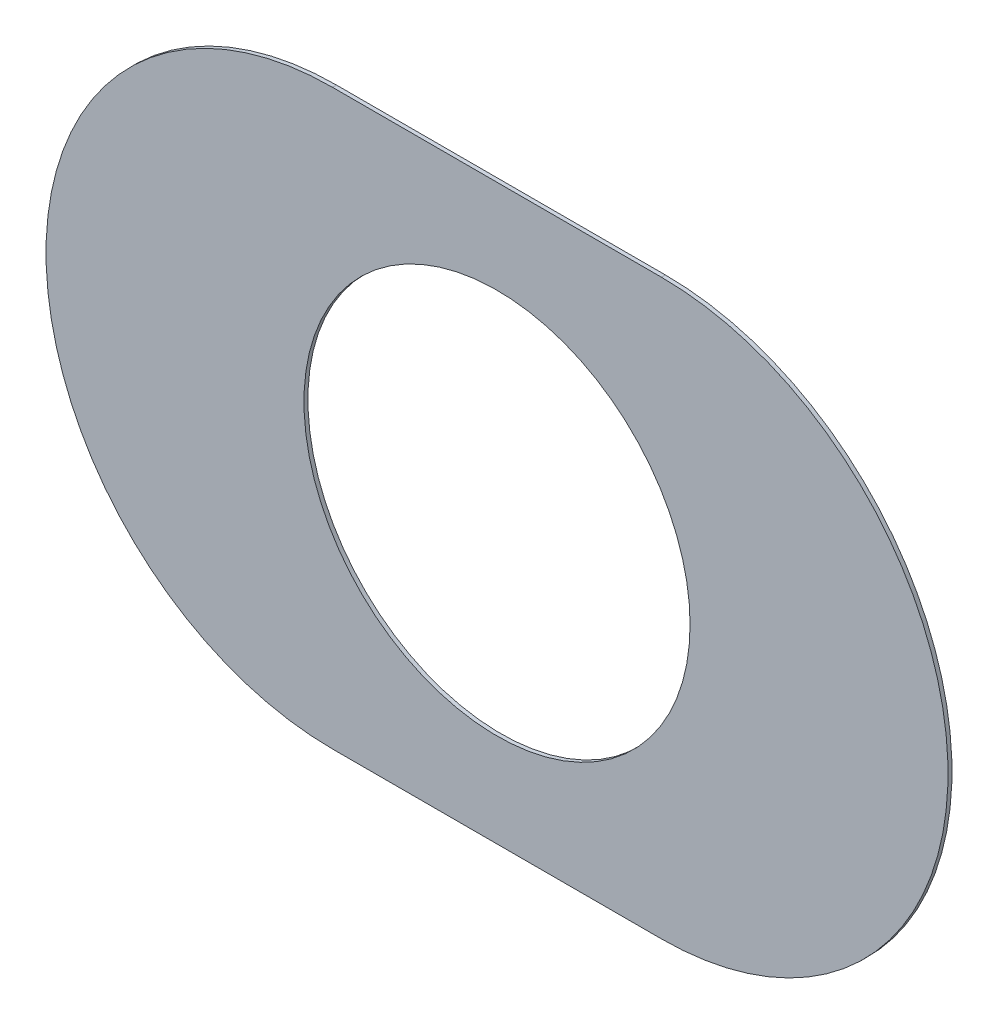
ISO-10303-21;
HEADER;
FILE_DESCRIPTION(('STEP AP214'),'2;1');
FILE_NAME('part.step','',(''),(''),'','','');
FILE_SCHEMA(('AUTOMOTIVE_DESIGN { 1 0 10303 214 1 1 1 1 }'));
ENDSEC;
DATA;
#1=APPLICATION_CONTEXT('core data for automotive mechanical design processes');
#2=APPLICATION_PROTOCOL_DEFINITION('international standard','automotive_design',2000,#1);
#3=PRODUCT_CONTEXT('',#1,'mechanical');
#4=PRODUCT('Part','Part','',(#3));
#5=PRODUCT_RELATED_PRODUCT_CATEGORY('part','',(#4));
#6=PRODUCT_DEFINITION_FORMATION('','',#4);
#7=PRODUCT_DEFINITION_CONTEXT('part definition',#1,'design');
#8=PRODUCT_DEFINITION('design','',#6,#7);
#9=PRODUCT_DEFINITION_SHAPE('','',#8);
#10=(LENGTH_UNIT() NAMED_UNIT(*) SI_UNIT(.MILLI.,.METRE.));
#11=(NAMED_UNIT(*) PLANE_ANGLE_UNIT() SI_UNIT($,.RADIAN.));
#12=(NAMED_UNIT(*) SI_UNIT($,.STERADIAN.) SOLID_ANGLE_UNIT());
#13=UNCERTAINTY_MEASURE_WITH_UNIT(LENGTH_MEASURE(1.E-05),#10,'distance_accuracy_value','');
#14=(GEOMETRIC_REPRESENTATION_CONTEXT(3) GLOBAL_UNCERTAINTY_ASSIGNED_CONTEXT((#13)) GLOBAL_UNIT_ASSIGNED_CONTEXT((#10,
#11,#12)) REPRESENTATION_CONTEXT('',''));
#15=CARTESIAN_POINT('',(0.,0.,0.));
#16=DIRECTION('',(0.,0.,1.));
#17=DIRECTION('',(1.,0.,0.));
#18=AXIS2_PLACEMENT_3D('',#15,#16,#17);
#19=CARTESIAN_POINT('',(24.3000003427268,42.4800006854535,0.));
#20=DIRECTION('',(0.,0.,1.));
#21=DIRECTION('',(1.,0.,0.));
#22=AXIS2_PLACEMENT_3D('',#19,#20,#21);
#23=PLANE('',#22);
#24=CARTESIAN_POINT('',(24.3000003427268,42.4800006854535,0.));
#25=DIRECTION('',(0.,0.,-1.));
#26=DIRECTION('',(-1.,0.,0.));
#27=AXIS2_PLACEMENT_3D('',#24,#25,#26);
#28=CIRCLE('',#27,0.49);
#29=CARTESIAN_POINT('',(24.7900003427268,42.4800006854535,0.));
#30=VERTEX_POINT('',#29);
#31=EDGE_CURVE('E21',#30,#30,#28,.T.);
#32=ORIENTED_EDGE('',*,*,#31,.T.);
#33=EDGE_LOOP('',(#32));
#34=FACE_BOUND('',#33,.T.);
#35=CARTESIAN_POINT('',(23.8825938881802,42.4800006854535,0.));
#36=DIRECTION('',(0.,0.,1.));
#37=DIRECTION('',(0.,1.,0.));
#38=AXIS2_PLACEMENT_3D('',#35,#36,#37);
#39=CIRCLE('',#38,0.727257121659981);
#40=CARTESIAN_POINT('',(23.8825938881802,43.2072578071135,0.));
#41=VERTEX_POINT('',#40);
#42=CARTESIAN_POINT('',(23.8825938881802,41.7527435637935,0.));
#43=VERTEX_POINT('',#42);
#44=EDGE_CURVE('E28',#41,#43,#39,.T.);
#45=ORIENTED_EDGE('',*,*,#44,.T.);
#46=DIRECTION('',(1.,0.,0.));
#47=VECTOR('',#46,1.);
#48=CARTESIAN_POINT('',(23.8825938881802,41.7527435637935,0.));
#49=LINE('',#48,#47);
#50=CARTESIAN_POINT('',(24.7174067972734,41.7527435637935,0.));
#51=VERTEX_POINT('',#50);
#52=EDGE_CURVE('E93',#43,#51,#49,.T.);
#53=ORIENTED_EDGE('',*,*,#52,.T.);
#54=CARTESIAN_POINT('',(24.7174067972734,42.4800006854535,0.));
#55=DIRECTION('',(0.,0.,1.));
#56=DIRECTION('',(0.,-1.,0.));
#57=AXIS2_PLACEMENT_3D('',#54,#55,#56);
#58=CIRCLE('',#57,0.727257121659981);
#59=CARTESIAN_POINT('',(24.7174067972734,43.2072578071135,0.));
#60=VERTEX_POINT('',#59);
#61=EDGE_CURVE('E114',#51,#60,#58,.T.);
#62=ORIENTED_EDGE('',*,*,#61,.T.);
#63=DIRECTION('',(-1.,0.,0.));
#64=VECTOR('',#63,1.);
#65=CARTESIAN_POINT('',(24.7174067972734,43.2072578071135,0.));
#66=LINE('',#65,#64);
#67=EDGE_CURVE('E105',#60,#41,#66,.T.);
#68=ORIENTED_EDGE('',*,*,#67,.T.);
#69=EDGE_LOOP('',(#45,#53,#62,#68));
#70=FACE_BOUND('',#69,.T.);
#71=ADVANCED_FACE('F17',(#34,#70),#23,.T.);
#72=CARTESIAN_POINT('',(24.3000003427268,42.4800006854535,-0.01));
#73=DIRECTION('',(0.,0.,1.));
#74=DIRECTION('',(1.,0.,0.));
#75=AXIS2_PLACEMENT_3D('',#72,#73,#74);
#76=PLANE('',#75);
#77=CARTESIAN_POINT('',(24.3000003427268,42.4800006854535,-0.01));
#78=DIRECTION('',(0.,0.,-1.));
#79=DIRECTION('',(-1.,0.,0.));
#80=AXIS2_PLACEMENT_3D('',#77,#78,#79);
#81=CIRCLE('',#80,0.49);
#82=CARTESIAN_POINT('',(24.7900003427268,42.4800006854535,-0.01));
#83=VERTEX_POINT('',#82);
#84=EDGE_CURVE('E140',#83,#83,#81,.T.);
#85=ORIENTED_EDGE('',*,*,#84,.F.);
#86=EDGE_LOOP('',(#85));
#87=FACE_BOUND('',#86,.T.);
#88=CARTESIAN_POINT('',(23.8825938881802,42.4800006854535,-0.01));
#89=DIRECTION('',(0.,0.,1.));
#90=DIRECTION('',(0.,1.,0.));
#91=AXIS2_PLACEMENT_3D('',#88,#89,#90);
#92=CIRCLE('',#91,0.727257121659981);
#93=CARTESIAN_POINT('',(23.8825938881802,43.2072578071135,-0.01));
#94=VERTEX_POINT('',#93);
#95=CARTESIAN_POINT('',(23.8825938881802,41.7527435637935,-0.01));
#96=VERTEX_POINT('',#95);
#97=EDGE_CURVE('E11',#94,#96,#92,.T.);
#98=ORIENTED_EDGE('',*,*,#97,.F.);
#99=DIRECTION('',(-1.,0.,0.));
#100=VECTOR('',#99,1.);
#101=CARTESIAN_POINT('',(24.7174067972734,43.2072578071135,-0.01));
#102=LINE('',#101,#100);
#103=CARTESIAN_POINT('',(24.7174067972734,43.2072578071135,-0.01));
#104=VERTEX_POINT('',#103);
#105=EDGE_CURVE('E96',#104,#94,#102,.T.);
#106=ORIENTED_EDGE('',*,*,#105,.F.);
#107=CARTESIAN_POINT('',(24.7174067972734,42.4800006854535,-0.01));
#108=DIRECTION('',(0.,0.,1.));
#109=DIRECTION('',(0.,-1.,0.));
#110=AXIS2_PLACEMENT_3D('',#107,#108,#109);
#111=CIRCLE('',#110,0.727257121659981);
#112=CARTESIAN_POINT('',(24.7174067972734,41.7527435637935,-0.01));
#113=VERTEX_POINT('',#112);
#114=EDGE_CURVE('E83',#113,#104,#111,.T.);
#115=ORIENTED_EDGE('',*,*,#114,.F.);
#116=DIRECTION('',(1.,0.,0.));
#117=VECTOR('',#116,1.);
#118=CARTESIAN_POINT('',(23.8825938881802,41.7527435637935,-0.01));
#119=LINE('',#118,#117);
#120=EDGE_CURVE('E123',#96,#113,#119,.T.);
#121=ORIENTED_EDGE('',*,*,#120,.F.);
#122=EDGE_LOOP('',(#98,#106,#115,#121));
#123=FACE_BOUND('',#122,.T.);
#124=ADVANCED_FACE('F97',(#87,#123),#76,.F.);
#125=CARTESIAN_POINT('',(23.8825938881802,42.4800006854535,0.));
#126=DIRECTION('',(0.,0.,1.));
#127=DIRECTION('',(0.,1.,0.));
#128=AXIS2_PLACEMENT_3D('',#125,#126,#127);
#129=CYLINDRICAL_SURFACE('',#128,0.727257121659981);
#130=ORIENTED_EDGE('',*,*,#44,.F.);
#131=DIRECTION('',(0.,0.,-1.));
#132=VECTOR('',#131,1.);
#133=CARTESIAN_POINT('',(23.8825938881802,43.2072578071135,0.));
#134=LINE('',#133,#132);
#135=EDGE_CURVE('E101',#41,#94,#134,.T.);
#136=ORIENTED_EDGE('',*,*,#135,.T.);
#137=ORIENTED_EDGE('',*,*,#97,.T.);
#138=DIRECTION('',(0.,0.,-1.));
#139=VECTOR('',#138,1.);
#140=CARTESIAN_POINT('',(23.8825938881802,41.7527435637935,0.));
#141=LINE('',#140,#139);
#142=EDGE_CURVE('E127',#43,#96,#141,.T.);
#143=ORIENTED_EDGE('',*,*,#142,.F.);
#144=EDGE_LOOP('',(#130,#136,#137,#143));
#145=FACE_BOUND('',#144,.T.);
#146=ADVANCED_FACE('F148',(#145),#129,.T.);
#147=CARTESIAN_POINT('',(23.8825938881802,41.7527435637935,0.));
#148=DIRECTION('',(0.,1.,0.));
#149=DIRECTION('',(1.,0.,0.));
#150=AXIS2_PLACEMENT_3D('',#147,#148,#149);
#151=PLANE('',#150);
#152=ORIENTED_EDGE('',*,*,#52,.F.);
#153=ORIENTED_EDGE('',*,*,#142,.T.);
#154=ORIENTED_EDGE('',*,*,#120,.T.);
#155=DIRECTION('',(0.,0.,-1.));
#156=VECTOR('',#155,1.);
#157=CARTESIAN_POINT('',(24.7174067972734,41.7527435637935,0.));
#158=LINE('',#157,#156);
#159=EDGE_CURVE('E90',#51,#113,#158,.T.);
#160=ORIENTED_EDGE('',*,*,#159,.F.);
#161=EDGE_LOOP('',(#152,#153,#154,#160));
#162=FACE_BOUND('',#161,.T.);
#163=ADVANCED_FACE('F155',(#162),#151,.F.);
#164=CARTESIAN_POINT('',(24.7174067972734,42.4800006854535,0.));
#165=DIRECTION('',(0.,0.,1.));
#166=DIRECTION('',(0.,-1.,0.));
#167=AXIS2_PLACEMENT_3D('',#164,#165,#166);
#168=CYLINDRICAL_SURFACE('',#167,0.727257121659981);
#169=ORIENTED_EDGE('',*,*,#61,.F.);
#170=ORIENTED_EDGE('',*,*,#159,.T.);
#171=ORIENTED_EDGE('',*,*,#114,.T.);
#172=DIRECTION('',(0.,0.,-1.));
#173=VECTOR('',#172,1.);
#174=CARTESIAN_POINT('',(24.7174067972734,43.2072578071135,0.));
#175=LINE('',#174,#173);
#176=EDGE_CURVE('E87',#60,#104,#175,.T.);
#177=ORIENTED_EDGE('',*,*,#176,.F.);
#178=EDGE_LOOP('',(#169,#170,#171,#177));
#179=FACE_BOUND('',#178,.T.);
#180=ADVANCED_FACE('F19',(#179),#168,.T.);
#181=CARTESIAN_POINT('',(24.7174067972734,43.2072578071135,0.));
#182=DIRECTION('',(0.,-1.,0.));
#183=DIRECTION('',(0.,0.,-1.));
#184=AXIS2_PLACEMENT_3D('',#181,#182,#183);
#185=PLANE('',#184);
#186=ORIENTED_EDGE('',*,*,#67,.F.);
#187=ORIENTED_EDGE('',*,*,#176,.T.);
#188=ORIENTED_EDGE('',*,*,#105,.T.);
#189=ORIENTED_EDGE('',*,*,#135,.F.);
#190=EDGE_LOOP('',(#186,#187,#188,#189));
#191=FACE_BOUND('',#190,.T.);
#192=ADVANCED_FACE('F103',(#191),#185,.F.);
#193=CARTESIAN_POINT('',(24.3000003427268,42.4800006854535,0.));
#194=DIRECTION('',(0.,0.,1.));
#195=DIRECTION('',(-1.,0.,0.));
#196=AXIS2_PLACEMENT_3D('',#193,#194,#195);
#197=CYLINDRICAL_SURFACE('',#196,0.49);
#198=ORIENTED_EDGE('',*,*,#84,.T.);
#199=DIRECTION('',(0.,0.,1.));
#200=VECTOR('',#199,1.);
#201=CARTESIAN_POINT('',(24.7900003427268,42.4800006854535,0.));
#202=LINE('',#201,#200);
#203=EDGE_CURVE('E62',#83,#30,#202,.T.);
#204=ORIENTED_EDGE('',*,*,#203,.T.);
#205=ORIENTED_EDGE('',*,*,#31,.F.);
#206=ORIENTED_EDGE('',*,*,#203,.F.);
#207=EDGE_LOOP('',(#198,#204,#205,#206));
#208=FACE_BOUND('',#207,.T.);
#209=ADVANCED_FACE('F145',(#208),#197,.F.);
#210=CLOSED_SHELL('',(#71,#124,#146,#163,#180,#192,#209));
#211=MANIFOLD_SOLID_BREP('B1',#210);
#212=ADVANCED_BREP_SHAPE_REPRESENTATION('',(#18,#211),#14);
#213=SHAPE_DEFINITION_REPRESENTATION(#9,#212);
ENDSEC;
END-ISO-10303-21;
